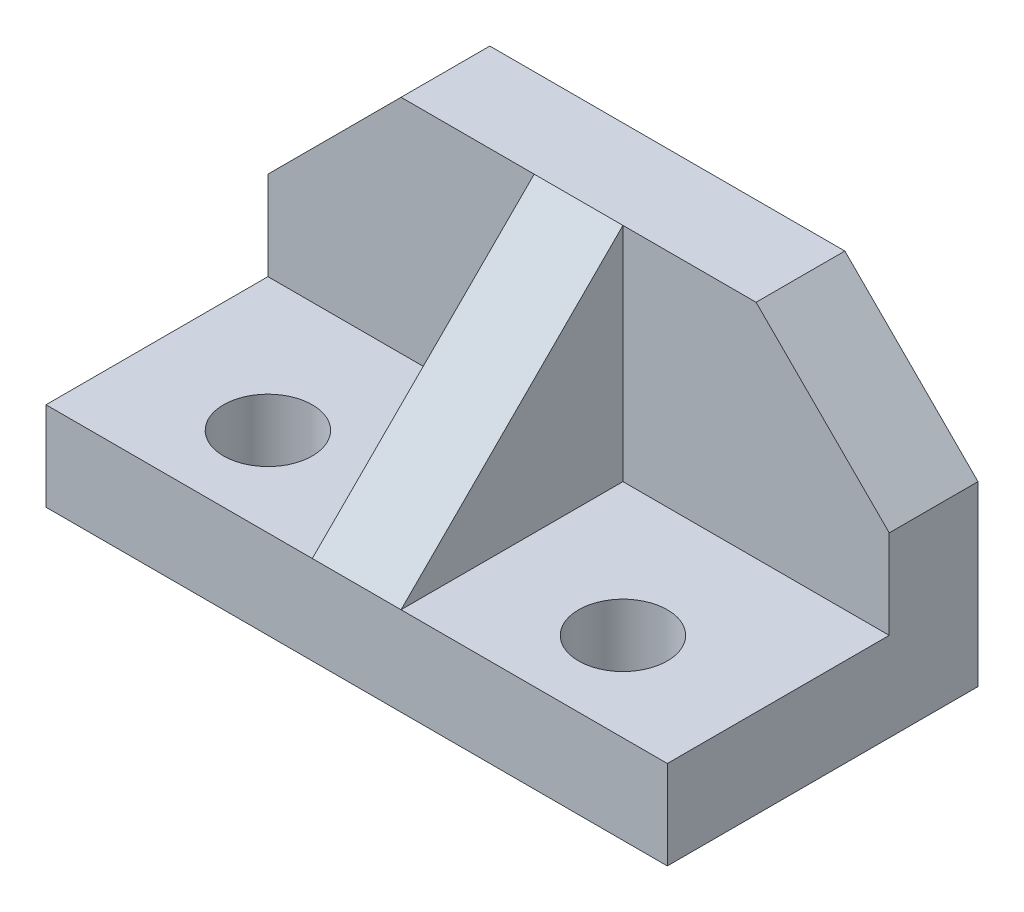
ISO-10303-21;
HEADER;
FILE_DESCRIPTION(('STEP AP214'),'2;1');
FILE_NAME('part.step','',(''),(''),'','','');
FILE_SCHEMA(('AUTOMOTIVE_DESIGN { 1 0 10303 214 1 1 1 1 }'));
ENDSEC;
DATA;
#1=APPLICATION_CONTEXT('core data for automotive mechanical design processes');
#2=APPLICATION_PROTOCOL_DEFINITION('international standard','automotive_design',2000,#1);
#3=PRODUCT_CONTEXT('',#1,'mechanical');
#4=PRODUCT('Part','Part','',(#3));
#5=PRODUCT_RELATED_PRODUCT_CATEGORY('part','',(#4));
#6=PRODUCT_DEFINITION_FORMATION('','',#4);
#7=PRODUCT_DEFINITION_CONTEXT('part definition',#1,'design');
#8=PRODUCT_DEFINITION('design','',#6,#7);
#9=PRODUCT_DEFINITION_SHAPE('','',#8);
#10=(LENGTH_UNIT() NAMED_UNIT(*) SI_UNIT(.MILLI.,.METRE.));
#11=(NAMED_UNIT(*) PLANE_ANGLE_UNIT() SI_UNIT($,.RADIAN.));
#12=(NAMED_UNIT(*) SI_UNIT($,.STERADIAN.) SOLID_ANGLE_UNIT());
#13=UNCERTAINTY_MEASURE_WITH_UNIT(LENGTH_MEASURE(1.E-05),#10,'distance_accuracy_value','');
#14=(GEOMETRIC_REPRESENTATION_CONTEXT(3) GLOBAL_UNCERTAINTY_ASSIGNED_CONTEXT((#13)) GLOBAL_UNIT_ASSIGNED_CONTEXT((#10,
#11,#12)) REPRESENTATION_CONTEXT('',''));
#15=CARTESIAN_POINT('',(0.,0.,0.));
#16=DIRECTION('',(0.,0.,1.));
#17=DIRECTION('',(1.,0.,0.));
#18=AXIS2_PLACEMENT_3D('',#15,#16,#17);
#19=CARTESIAN_POINT('',(0.,35.,0.));
#20=DIRECTION('',(1.,0.,0.));
#21=DIRECTION('',(0.,0.,-1.));
#22=AXIS2_PLACEMENT_3D('',#19,#20,#21);
#23=PLANE('',#22);
#24=DIRECTION('',(0.,-1.,0.));
#25=VECTOR('',#24,1.);
#26=CARTESIAN_POINT('',(0.,35.,-25.));
#27=LINE('',#26,#25);
#28=CARTESIAN_POINT('',(0.,20.,-25.));
#29=VERTEX_POINT('',#28);
#30=CARTESIAN_POINT('',(0.,10.,-25.));
#31=VERTEX_POINT('',#30);
#32=EDGE_CURVE('E159',#29,#31,#27,.T.);
#33=ORIENTED_EDGE('',*,*,#32,.F.);
#34=DIRECTION('',(0.,0.,1.));
#35=VECTOR('',#34,1.);
#36=CARTESIAN_POINT('',(0.,20.,-50.));
#37=LINE('',#36,#35);
#38=CARTESIAN_POINT('',(0.,20.,-35.));
#39=VERTEX_POINT('',#38);
#40=EDGE_CURVE('E54',#39,#29,#37,.T.);
#41=ORIENTED_EDGE('',*,*,#40,.F.);
#42=DIRECTION('',(0.,-1.,0.));
#43=VECTOR('',#42,1.);
#44=CARTESIAN_POINT('',(0.,35.,-35.));
#45=LINE('',#44,#43);
#46=CARTESIAN_POINT('',(0.,0.,-35.));
#47=VERTEX_POINT('',#46);
#48=EDGE_CURVE('E193',#39,#47,#45,.T.);
#49=ORIENTED_EDGE('',*,*,#48,.T.);
#50=DIRECTION('',(0.,0.,1.));
#51=VECTOR('',#50,1.);
#52=CARTESIAN_POINT('',(0.,0.,0.));
#53=LINE('',#52,#51);
#54=CARTESIAN_POINT('',(0.,0.,0.));
#55=VERTEX_POINT('',#54);
#56=EDGE_CURVE('E187',#47,#55,#53,.T.);
#57=ORIENTED_EDGE('',*,*,#56,.T.);
#58=DIRECTION('',(0.,-1.,0.));
#59=VECTOR('',#58,1.);
#60=CARTESIAN_POINT('',(0.,35.,0.));
#61=LINE('',#60,#59);
#62=CARTESIAN_POINT('',(0.,10.,0.));
#63=VERTEX_POINT('',#62);
#64=EDGE_CURVE('E11',#63,#55,#61,.T.);
#65=ORIENTED_EDGE('',*,*,#64,.F.);
#66=DIRECTION('',(0.,0.,1.));
#67=VECTOR('',#66,1.);
#68=CARTESIAN_POINT('',(0.,10.,-25.));
#69=LINE('',#68,#67);
#70=EDGE_CURVE('E146',#31,#63,#69,.T.);
#71=ORIENTED_EDGE('',*,*,#70,.F.);
#72=EDGE_LOOP('',(#33,#41,#49,#57,#65,#71));
#73=FACE_BOUND('',#72,.T.);
#74=ADVANCED_FACE('F39',(#73),#23,.F.);
#75=CARTESIAN_POINT('',(0.,35.,0.));
#76=DIRECTION('',(0.,0.,-1.));
#77=DIRECTION('',(-1.,0.,0.));
#78=AXIS2_PLACEMENT_3D('',#75,#76,#77);
#79=PLANE('',#78);
#80=DIRECTION('',(1.,0.,0.));
#81=VECTOR('',#80,1.);
#82=CARTESIAN_POINT('',(70.,10.,0.));
#83=LINE('',#82,#81);
#84=CARTESIAN_POINT('',(40.,9.99999999999999,0.));
#85=VERTEX_POINT('',#84);
#86=CARTESIAN_POINT('',(70.,10.,0.));
#87=VERTEX_POINT('',#86);
#88=EDGE_CURVE('E163',#85,#87,#83,.T.);
#89=ORIENTED_EDGE('',*,*,#88,.F.);
#90=DIRECTION('',(1.,0.,0.));
#91=VECTOR('',#90,1.);
#92=CARTESIAN_POINT('',(15.,9.99999999999999,0.));
#93=LINE('',#92,#91);
#94=CARTESIAN_POINT('',(30.,9.99999999999999,0.));
#95=VERTEX_POINT('',#94);
#96=EDGE_CURVE('E248',#95,#85,#93,.T.);
#97=ORIENTED_EDGE('',*,*,#96,.F.);
#98=DIRECTION('',(1.,0.,0.));
#99=VECTOR('',#98,1.);
#100=CARTESIAN_POINT('',(0.,10.,0.));
#101=LINE('',#100,#99);
#102=EDGE_CURVE('E156',#63,#95,#101,.T.);
#103=ORIENTED_EDGE('',*,*,#102,.F.);
#104=ORIENTED_EDGE('',*,*,#64,.T.);
#105=DIRECTION('',(1.,0.,0.));
#106=VECTOR('',#105,1.);
#107=CARTESIAN_POINT('',(0.,0.,0.));
#108=LINE('',#107,#106);
#109=CARTESIAN_POINT('',(70.,0.,0.));
#110=VERTEX_POINT('',#109);
#111=EDGE_CURVE('E198',#55,#110,#108,.T.);
#112=ORIENTED_EDGE('',*,*,#111,.T.);
#113=DIRECTION('',(0.,-1.,0.));
#114=VECTOR('',#113,1.);
#115=CARTESIAN_POINT('',(70.,35.,0.));
#116=LINE('',#115,#114);
#117=EDGE_CURVE('E47',#87,#110,#116,.T.);
#118=ORIENTED_EDGE('',*,*,#117,.F.);
#119=EDGE_LOOP('',(#89,#97,#103,#104,#112,#118));
#120=FACE_BOUND('',#119,.T.);
#121=ADVANCED_FACE('F224',(#120),#79,.F.);
#122=CARTESIAN_POINT('',(70.,35.,0.));
#123=DIRECTION('',(-1.,0.,0.));
#124=DIRECTION('',(0.,0.,1.));
#125=AXIS2_PLACEMENT_3D('',#122,#123,#124);
#126=PLANE('',#125);
#127=DIRECTION('',(0.,-1.,0.));
#128=VECTOR('',#127,1.);
#129=CARTESIAN_POINT('',(70.,35.,-35.));
#130=LINE('',#129,#128);
#131=CARTESIAN_POINT('',(70.,20.,-35.));
#132=VERTEX_POINT('',#131);
#133=CARTESIAN_POINT('',(70.,0.,-35.));
#134=VERTEX_POINT('',#133);
#135=EDGE_CURVE('E211',#132,#134,#130,.T.);
#136=ORIENTED_EDGE('',*,*,#135,.F.);
#137=DIRECTION('',(0.,0.,1.));
#138=VECTOR('',#137,1.);
#139=CARTESIAN_POINT('',(70.,20.,-50.));
#140=LINE('',#139,#138);
#141=CARTESIAN_POINT('',(70.,20.,-25.));
#142=VERTEX_POINT('',#141);
#143=EDGE_CURVE('E236',#132,#142,#140,.T.);
#144=ORIENTED_EDGE('',*,*,#143,.T.);
#145=DIRECTION('',(0.,1.,0.));
#146=VECTOR('',#145,1.);
#147=CARTESIAN_POINT('',(70.,35.,-25.));
#148=LINE('',#147,#146);
#149=CARTESIAN_POINT('',(70.,10.,-25.));
#150=VERTEX_POINT('',#149);
#151=EDGE_CURVE('E165',#150,#142,#148,.T.);
#152=ORIENTED_EDGE('',*,*,#151,.F.);
#153=DIRECTION('',(0.,0.,1.));
#154=VECTOR('',#153,1.);
#155=CARTESIAN_POINT('',(70.,10.,-25.));
#156=LINE('',#155,#154);
#157=EDGE_CURVE('E183',#150,#87,#156,.T.);
#158=ORIENTED_EDGE('',*,*,#157,.T.);
#159=ORIENTED_EDGE('',*,*,#117,.T.);
#160=DIRECTION('',(0.,0.,-1.));
#161=VECTOR('',#160,1.);
#162=CARTESIAN_POINT('',(70.,0.,0.));
#163=LINE('',#162,#161);
#164=EDGE_CURVE('E202',#110,#134,#163,.T.);
#165=ORIENTED_EDGE('',*,*,#164,.T.);
#166=EDGE_LOOP('',(#136,#144,#152,#158,#159,#165));
#167=FACE_BOUND('',#166,.T.);
#168=ADVANCED_FACE('F217',(#167),#126,.F.);
#169=CARTESIAN_POINT('',(0.,35.,-35.));
#170=DIRECTION('',(0.,0.,1.));
#171=DIRECTION('',(1.,0.,0.));
#172=AXIS2_PLACEMENT_3D('',#169,#170,#171);
#173=PLANE('',#172);
#174=ORIENTED_EDGE('',*,*,#48,.F.);
#175=DIRECTION('',(0.707106781186548,0.707106781186548,0.));
#176=VECTOR('',#175,1.);
#177=CARTESIAN_POINT('',(7.5,27.5,-35.));
#178=LINE('',#177,#176);
#179=CARTESIAN_POINT('',(15.,35.,-35.));
#180=VERTEX_POINT('',#179);
#181=EDGE_CURVE('E138',#39,#180,#178,.T.);
#182=ORIENTED_EDGE('',*,*,#181,.T.);
#183=DIRECTION('',(-1.,0.,0.));
#184=VECTOR('',#183,1.);
#185=CARTESIAN_POINT('',(0.,35.,-35.));
#186=LINE('',#185,#184);
#187=CARTESIAN_POINT('',(55.,35.,-35.));
#188=VERTEX_POINT('',#187);
#189=EDGE_CURVE('E136',#188,#180,#186,.T.);
#190=ORIENTED_EDGE('',*,*,#189,.F.);
#191=DIRECTION('',(0.707106781186548,-0.707106781186547,0.));
#192=VECTOR('',#191,1.);
#193=CARTESIAN_POINT('',(27.5,62.5,-35.));
#194=LINE('',#193,#192);
#195=EDGE_CURVE('E234',#188,#132,#194,.T.);
#196=ORIENTED_EDGE('',*,*,#195,.T.);
#197=ORIENTED_EDGE('',*,*,#135,.T.);
#198=DIRECTION('',(-1.,0.,0.));
#199=VECTOR('',#198,1.);
#200=CARTESIAN_POINT('',(0.,0.,-35.));
#201=LINE('',#200,#199);
#202=EDGE_CURVE('E194',#134,#47,#201,.T.);
#203=ORIENTED_EDGE('',*,*,#202,.T.);
#204=EDGE_LOOP('',(#174,#182,#190,#196,#197,#203));
#205=FACE_BOUND('',#204,.T.);
#206=ADVANCED_FACE('F232',(#205),#173,.F.);
#207=CARTESIAN_POINT('',(0.,35.,0.));
#208=DIRECTION('',(0.,-1.,0.));
#209=DIRECTION('',(0.,0.,-1.));
#210=AXIS2_PLACEMENT_3D('',#207,#208,#209);
#211=PLANE('',#210);
#212=ORIENTED_EDGE('',*,*,#189,.T.);
#213=DIRECTION('',(0.,0.,1.));
#214=VECTOR('',#213,1.);
#215=CARTESIAN_POINT('',(15.,35.,-50.));
#216=LINE('',#215,#214);
#217=CARTESIAN_POINT('',(15.,35.,-25.));
#218=VERTEX_POINT('',#217);
#219=EDGE_CURVE('E121',#180,#218,#216,.T.);
#220=ORIENTED_EDGE('',*,*,#219,.T.);
#221=DIRECTION('',(-1.,0.,0.));
#222=VECTOR('',#221,1.);
#223=CARTESIAN_POINT('',(0.,35.,-25.));
#224=LINE('',#223,#222);
#225=CARTESIAN_POINT('',(30.,35.,-25.));
#226=VERTEX_POINT('',#225);
#227=EDGE_CURVE('E134',#226,#218,#224,.T.);
#228=ORIENTED_EDGE('',*,*,#227,.F.);
#229=DIRECTION('',(1.,0.,0.));
#230=VECTOR('',#229,1.);
#231=CARTESIAN_POINT('',(15.,35.,-25.));
#232=LINE('',#231,#230);
#233=CARTESIAN_POINT('',(40.,35.,-25.));
#234=VERTEX_POINT('',#233);
#235=EDGE_CURVE('E254',#226,#234,#232,.T.);
#236=ORIENTED_EDGE('',*,*,#235,.T.);
#237=DIRECTION('',(-1.,0.,0.));
#238=VECTOR('',#237,1.);
#239=CARTESIAN_POINT('',(70.,35.,-25.));
#240=LINE('',#239,#238);
#241=CARTESIAN_POINT('',(55.,35.,-25.));
#242=VERTEX_POINT('',#241);
#243=EDGE_CURVE('E169',#242,#234,#240,.T.);
#244=ORIENTED_EDGE('',*,*,#243,.F.);
#245=DIRECTION('',(0.,0.,1.));
#246=VECTOR('',#245,1.);
#247=CARTESIAN_POINT('',(55.,35.,-50.));
#248=LINE('',#247,#246);
#249=EDGE_CURVE('E62',#188,#242,#248,.T.);
#250=ORIENTED_EDGE('',*,*,#249,.F.);
#251=EDGE_LOOP('',(#212,#220,#228,#236,#244,#250));
#252=FACE_BOUND('',#251,.T.);
#253=ADVANCED_FACE('F132',(#252),#211,.F.);
#254=CARTESIAN_POINT('',(0.,0.,0.));
#255=DIRECTION('',(0.,-1.,0.));
#256=DIRECTION('',(0.,0.,-1.));
#257=AXIS2_PLACEMENT_3D('',#254,#255,#256);
#258=PLANE('',#257);
#259=CARTESIAN_POINT('',(15.,0.,-10.));
#260=DIRECTION('',(0.,1.,0.));
#261=DIRECTION('',(0.,0.,1.));
#262=AXIS2_PLACEMENT_3D('',#259,#260,#261);
#263=CIRCLE('',#262,5.);
#264=CARTESIAN_POINT('',(15.,0.,-5.));
#265=VERTEX_POINT('',#264);
#266=EDGE_CURVE('E434',#265,#265,#263,.T.);
#267=ORIENTED_EDGE('',*,*,#266,.T.);
#268=EDGE_LOOP('',(#267));
#269=FACE_BOUND('',#268,.T.);
#270=CARTESIAN_POINT('',(55.,0.,-10.));
#271=DIRECTION('',(0.,1.,0.));
#272=DIRECTION('',(-1.,0.,0.));
#273=AXIS2_PLACEMENT_3D('',#270,#271,#272);
#274=CIRCLE('',#273,5.);
#275=CARTESIAN_POINT('',(50.,0.,-10.));
#276=VERTEX_POINT('',#275);
#277=EDGE_CURVE('E127',#276,#276,#274,.T.);
#278=ORIENTED_EDGE('',*,*,#277,.T.);
#279=EDGE_LOOP('',(#278));
#280=FACE_BOUND('',#279,.T.);
#281=ORIENTED_EDGE('',*,*,#56,.F.);
#282=ORIENTED_EDGE('',*,*,#202,.F.);
#283=ORIENTED_EDGE('',*,*,#164,.F.);
#284=ORIENTED_EDGE('',*,*,#111,.F.);
#285=EDGE_LOOP('',(#281,#282,#283,#284));
#286=FACE_BOUND('',#285,.T.);
#287=ADVANCED_FACE('F229',(#269,#280,#286),#258,.T.);
#288=CARTESIAN_POINT('',(70.,10.,-25.));
#289=DIRECTION('',(0.,-1.,0.));
#290=DIRECTION('',(1.,0.,0.));
#291=AXIS2_PLACEMENT_3D('',#288,#289,#290);
#292=PLANE('',#291);
#293=CARTESIAN_POINT('',(55.,10.,-10.));
#294=DIRECTION('',(0.,1.,0.));
#295=DIRECTION('',(-1.,0.,0.));
#296=AXIS2_PLACEMENT_3D('',#293,#294,#295);
#297=CIRCLE('',#296,5.);
#298=CARTESIAN_POINT('',(50.,10.,-10.));
#299=VERTEX_POINT('',#298);
#300=EDGE_CURVE('E438',#299,#299,#297,.T.);
#301=ORIENTED_EDGE('',*,*,#300,.F.);
#302=EDGE_LOOP('',(#301));
#303=FACE_BOUND('',#302,.T.);
#304=ORIENTED_EDGE('',*,*,#88,.T.);
#305=ORIENTED_EDGE('',*,*,#157,.F.);
#306=DIRECTION('',(1.,0.,0.));
#307=VECTOR('',#306,1.);
#308=CARTESIAN_POINT('',(70.,10.,-25.));
#309=LINE('',#308,#307);
#310=CARTESIAN_POINT('',(40.,9.99999999999999,-25.));
#311=VERTEX_POINT('',#310);
#312=EDGE_CURVE('E176',#311,#150,#309,.T.);
#313=ORIENTED_EDGE('',*,*,#312,.F.);
#314=DIRECTION('',(0.,0.,1.));
#315=VECTOR('',#314,1.);
#316=CARTESIAN_POINT('',(40.,9.99999999999999,-25.));
#317=LINE('',#316,#315);
#318=EDGE_CURVE('E180',#311,#85,#317,.T.);
#319=ORIENTED_EDGE('',*,*,#318,.T.);
#320=EDGE_LOOP('',(#304,#305,#313,#319));
#321=FACE_BOUND('',#320,.T.);
#322=ADVANCED_FACE('F246',(#303,#321),#292,.F.);
#323=CARTESIAN_POINT('',(40.,35.,-25.));
#324=DIRECTION('',(-1.,0.,0.));
#325=DIRECTION('',(0.,-1.,0.));
#326=AXIS2_PLACEMENT_3D('',#323,#324,#325);
#327=PLANE('',#326);
#328=DIRECTION('',(0.,-1.,0.));
#329=VECTOR('',#328,1.);
#330=CARTESIAN_POINT('',(40.,35.,-25.));
#331=LINE('',#330,#329);
#332=EDGE_CURVE('E172',#234,#311,#331,.T.);
#333=ORIENTED_EDGE('',*,*,#332,.F.);
#334=DIRECTION('',(0.,0.707106781186547,-0.707106781186547));
#335=VECTOR('',#334,1.);
#336=CARTESIAN_POINT('',(40.,9.99999999999999,0.));
#337=LINE('',#336,#335);
#338=EDGE_CURVE('E255',#85,#234,#337,.T.);
#339=ORIENTED_EDGE('',*,*,#338,.F.);
#340=ORIENTED_EDGE('',*,*,#318,.F.);
#341=EDGE_LOOP('',(#333,#339,#340));
#342=FACE_BOUND('',#341,.T.);
#343=ADVANCED_FACE('F286',(#342),#327,.F.);
#344=CARTESIAN_POINT('',(0.,0.,-25.));
#345=DIRECTION('',(0.,0.,-1.));
#346=DIRECTION('',(-1.,0.,0.));
#347=AXIS2_PLACEMENT_3D('',#344,#345,#346);
#348=PLANE('',#347);
#349=ORIENTED_EDGE('',*,*,#151,.T.);
#350=DIRECTION('',(0.707106781186548,-0.707106781186547,0.));
#351=VECTOR('',#350,1.);
#352=CARTESIAN_POINT('',(70.,20.,-25.));
#353=LINE('',#352,#351);
#354=EDGE_CURVE('E241',#242,#142,#353,.T.);
#355=ORIENTED_EDGE('',*,*,#354,.F.);
#356=ORIENTED_EDGE('',*,*,#243,.T.);
#357=ORIENTED_EDGE('',*,*,#332,.T.);
#358=ORIENTED_EDGE('',*,*,#312,.T.);
#359=EDGE_LOOP('',(#349,#355,#356,#357,#358));
#360=FACE_BOUND('',#359,.T.);
#361=ADVANCED_FACE('F240',(#360),#348,.F.);
#362=CARTESIAN_POINT('',(30.,35.,-25.));
#363=DIRECTION('',(1.,0.,0.));
#364=DIRECTION('',(0.,1.,0.));
#365=AXIS2_PLACEMENT_3D('',#362,#363,#364);
#366=PLANE('',#365);
#367=DIRECTION('',(0.,0.,1.));
#368=VECTOR('',#367,1.);
#369=CARTESIAN_POINT('',(30.,10.,-25.));
#370=LINE('',#369,#368);
#371=CARTESIAN_POINT('',(30.,10.,-25.));
#372=VERTEX_POINT('',#371);
#373=EDGE_CURVE('E150',#372,#95,#370,.T.);
#374=ORIENTED_EDGE('',*,*,#373,.T.);
#375=DIRECTION('',(0.,0.707106781186548,-0.707106781186548));
#376=VECTOR('',#375,1.);
#377=CARTESIAN_POINT('',(30.,35.,-25.));
#378=LINE('',#377,#376);
#379=EDGE_CURVE('E160',#95,#226,#378,.T.);
#380=ORIENTED_EDGE('',*,*,#379,.T.);
#381=DIRECTION('',(0.,1.,0.));
#382=VECTOR('',#381,1.);
#383=CARTESIAN_POINT('',(30.,35.,-25.));
#384=LINE('',#383,#382);
#385=EDGE_CURVE('E144',#372,#226,#384,.T.);
#386=ORIENTED_EDGE('',*,*,#385,.F.);
#387=EDGE_LOOP('',(#374,#380,#386));
#388=FACE_BOUND('',#387,.T.);
#389=ADVANCED_FACE('F259',(#388),#366,.F.);
#390=CARTESIAN_POINT('',(0.,10.,-25.));
#391=DIRECTION('',(0.,-1.,0.));
#392=DIRECTION('',(0.,0.,-1.));
#393=AXIS2_PLACEMENT_3D('',#390,#391,#392);
#394=PLANE('',#393);
#395=CARTESIAN_POINT('',(15.,10.,-10.));
#396=DIRECTION('',(0.,1.,0.));
#397=DIRECTION('',(0.,0.,1.));
#398=AXIS2_PLACEMENT_3D('',#395,#396,#397);
#399=CIRCLE('',#398,5.);
#400=CARTESIAN_POINT('',(15.,10.,-5.));
#401=VERTEX_POINT('',#400);
#402=EDGE_CURVE('E431',#401,#401,#399,.T.);
#403=ORIENTED_EDGE('',*,*,#402,.F.);
#404=EDGE_LOOP('',(#403));
#405=FACE_BOUND('',#404,.T.);
#406=ORIENTED_EDGE('',*,*,#102,.T.);
#407=ORIENTED_EDGE('',*,*,#373,.F.);
#408=DIRECTION('',(1.,0.,0.));
#409=VECTOR('',#408,1.);
#410=CARTESIAN_POINT('',(0.,10.,-25.));
#411=LINE('',#410,#409);
#412=EDGE_CURVE('E152',#31,#372,#411,.T.);
#413=ORIENTED_EDGE('',*,*,#412,.F.);
#414=ORIENTED_EDGE('',*,*,#70,.T.);
#415=EDGE_LOOP('',(#406,#407,#413,#414));
#416=FACE_BOUND('',#415,.T.);
#417=ADVANCED_FACE('F262',(#405,#416),#394,.F.);
#418=CARTESIAN_POINT('',(0.,0.,-25.));
#419=DIRECTION('',(0.,0.,1.));
#420=DIRECTION('',(1.,0.,0.));
#421=AXIS2_PLACEMENT_3D('',#418,#419,#420);
#422=PLANE('',#421);
#423=DIRECTION('',(0.707106781186547,0.707106781186547,0.));
#424=VECTOR('',#423,1.);
#425=CARTESIAN_POINT('',(0.,20.,-25.));
#426=LINE('',#425,#424);
#427=EDGE_CURVE('E118',#29,#218,#426,.T.);
#428=ORIENTED_EDGE('',*,*,#427,.F.);
#429=ORIENTED_EDGE('',*,*,#32,.T.);
#430=ORIENTED_EDGE('',*,*,#412,.T.);
#431=ORIENTED_EDGE('',*,*,#385,.T.);
#432=ORIENTED_EDGE('',*,*,#227,.T.);
#433=EDGE_LOOP('',(#428,#429,#430,#431,#432));
#434=FACE_BOUND('',#433,.T.);
#435=ADVANCED_FACE('F141',(#434),#422,.T.);
#436=CARTESIAN_POINT('',(15.,9.99999999999999,0.));
#437=DIRECTION('',(0.,-0.707106781186547,-0.707106781186547));
#438=DIRECTION('',(0.,0.707106781186548,-0.707106781186548));
#439=AXIS2_PLACEMENT_3D('',#436,#437,#438);
#440=PLANE('',#439);
#441=ORIENTED_EDGE('',*,*,#96,.T.);
#442=ORIENTED_EDGE('',*,*,#338,.T.);
#443=ORIENTED_EDGE('',*,*,#235,.F.);
#444=ORIENTED_EDGE('',*,*,#379,.F.);
#445=EDGE_LOOP('',(#441,#442,#443,#444));
#446=FACE_BOUND('',#445,.T.);
#447=ADVANCED_FACE('F264',(#446),#440,.F.);
#448=CARTESIAN_POINT('',(70.,20.,-50.));
#449=DIRECTION('',(-0.707106781186547,-0.707106781186548,0.));
#450=DIRECTION('',(0.707106781186548,-0.707106781186547,0.));
#451=AXIS2_PLACEMENT_3D('',#448,#449,#450);
#452=PLANE('',#451);
#453=ORIENTED_EDGE('',*,*,#249,.T.);
#454=ORIENTED_EDGE('',*,*,#354,.T.);
#455=ORIENTED_EDGE('',*,*,#143,.F.);
#456=ORIENTED_EDGE('',*,*,#195,.F.);
#457=EDGE_LOOP('',(#453,#454,#455,#456));
#458=FACE_BOUND('',#457,.T.);
#459=ADVANCED_FACE('F376',(#458),#452,.F.);
#460=CARTESIAN_POINT('',(0.,20.,-50.));
#461=DIRECTION('',(0.707106781186547,-0.707106781186547,0.));
#462=DIRECTION('',(0.707106781186548,0.707106781186548,0.));
#463=AXIS2_PLACEMENT_3D('',#460,#461,#462);
#464=PLANE('',#463);
#465=ORIENTED_EDGE('',*,*,#40,.T.);
#466=ORIENTED_EDGE('',*,*,#427,.T.);
#467=ORIENTED_EDGE('',*,*,#219,.F.);
#468=ORIENTED_EDGE('',*,*,#181,.F.);
#469=EDGE_LOOP('',(#465,#466,#467,#468));
#470=FACE_BOUND('',#469,.T.);
#471=ADVANCED_FACE('F120',(#470),#464,.F.);
#472=CARTESIAN_POINT('',(55.,0.,-10.));
#473=DIRECTION('',(0.,1.,0.));
#474=DIRECTION('',(-1.,0.,0.));
#475=AXIS2_PLACEMENT_3D('',#472,#473,#474);
#476=CYLINDRICAL_SURFACE('',#475,5.);
#477=ORIENTED_EDGE('',*,*,#277,.F.);
#478=EDGE_LOOP('',(#477));
#479=FACE_BOUND('',#478,.T.);
#480=ORIENTED_EDGE('',*,*,#300,.T.);
#481=EDGE_LOOP('',(#480));
#482=FACE_BOUND('',#481,.T.);
#483=ADVANCED_FACE('F335',(#479,#482),#476,.F.);
#484=CARTESIAN_POINT('',(15.,0.,-10.));
#485=DIRECTION('',(0.,1.,0.));
#486=DIRECTION('',(0.,0.,1.));
#487=AXIS2_PLACEMENT_3D('',#484,#485,#486);
#488=CYLINDRICAL_SURFACE('',#487,5.);
#489=ORIENTED_EDGE('',*,*,#266,.F.);
#490=EDGE_LOOP('',(#489));
#491=FACE_BOUND('',#490,.T.);
#492=ORIENTED_EDGE('',*,*,#402,.T.);
#493=EDGE_LOOP('',(#492));
#494=FACE_BOUND('',#493,.T.);
#495=ADVANCED_FACE('F339',(#491,#494),#488,.F.);
#496=CLOSED_SHELL('',(#74,#121,#168,#206,#253,#287,#322,#343,#361,#389,#417,#435,#447,#459,#471,
#483,#495));
#497=MANIFOLD_SOLID_BREP('B2',#496);
#498=ADVANCED_BREP_SHAPE_REPRESENTATION('',(#18,#497),#14);
#499=SHAPE_DEFINITION_REPRESENTATION(#9,#498);
ENDSEC;
END-ISO-10303-21;
